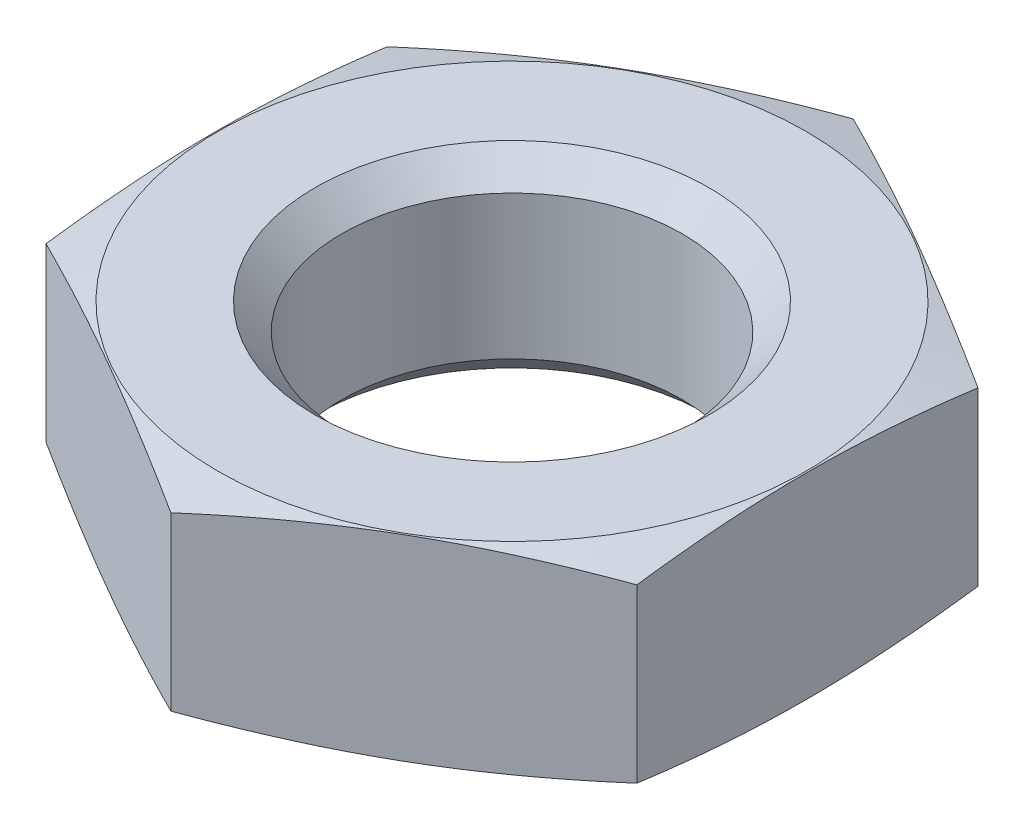
ISO-10303-21;
HEADER;
FILE_DESCRIPTION(('STEP AP214'),'2;1');
FILE_NAME('part.step','',(''),(''),'','','');
FILE_SCHEMA(('AUTOMOTIVE_DESIGN { 1 0 10303 214 1 1 1 1 }'));
ENDSEC;
DATA;
#1=APPLICATION_CONTEXT('core data for automotive mechanical design processes');
#2=APPLICATION_PROTOCOL_DEFINITION('international standard','automotive_design',2000,#1);
#3=PRODUCT_CONTEXT('',#1,'mechanical');
#4=PRODUCT('Part','Part','',(#3));
#5=PRODUCT_RELATED_PRODUCT_CATEGORY('part','',(#4));
#6=PRODUCT_DEFINITION_FORMATION('','',#4);
#7=PRODUCT_DEFINITION_CONTEXT('part definition',#1,'design');
#8=PRODUCT_DEFINITION('design','',#6,#7);
#9=PRODUCT_DEFINITION_SHAPE('','',#8);
#10=(LENGTH_UNIT() NAMED_UNIT(*) SI_UNIT(.MILLI.,.METRE.));
#11=(NAMED_UNIT(*) PLANE_ANGLE_UNIT() SI_UNIT($,.RADIAN.));
#12=(NAMED_UNIT(*) SI_UNIT($,.STERADIAN.) SOLID_ANGLE_UNIT());
#13=UNCERTAINTY_MEASURE_WITH_UNIT(LENGTH_MEASURE(1.E-05),#10,'distance_accuracy_value','');
#14=(GEOMETRIC_REPRESENTATION_CONTEXT(3) GLOBAL_UNCERTAINTY_ASSIGNED_CONTEXT((#13)) GLOBAL_UNIT_ASSIGNED_CONTEXT((#10,
#11,#12)) REPRESENTATION_CONTEXT('',''));
#15=CARTESIAN_POINT('',(0.,0.,0.));
#16=DIRECTION('',(0.,0.,1.));
#17=DIRECTION('',(1.,0.,0.));
#18=AXIS2_PLACEMENT_3D('',#15,#16,#17);
#19=CARTESIAN_POINT('',(0.,0.,0.));
#20=DIRECTION('',(0.,1.,0.));
#21=DIRECTION('',(0.,0.,1.));
#22=AXIS2_PLACEMENT_3D('',#19,#20,#21);
#23=PLANE('',#22);
#24=CARTESIAN_POINT('',(0.,0.,0.));
#25=DIRECTION('',(0.,1.,0.));
#26=DIRECTION('',(0.,0.,1.));
#27=AXIS2_PLACEMENT_3D('',#24,#25,#26);
#28=CIRCLE('',#27,8.);
#29=CARTESIAN_POINT('',(0.,0.,8.));
#30=VERTEX_POINT('',#29);
#31=EDGE_CURVE('E104',#30,#30,#28,.T.);
#32=ORIENTED_EDGE('',*,*,#31,.F.);
#33=EDGE_LOOP('',(#32));
#34=FACE_BOUND('',#33,.T.);
#35=CARTESIAN_POINT('',(0.,0.,0.));
#36=DIRECTION('',(0.,-1.,0.));
#37=DIRECTION('',(0.,0.,-1.));
#38=AXIS2_PLACEMENT_3D('',#35,#36,#37);
#39=CIRCLE('',#38,11.95);
#40=CARTESIAN_POINT('',(0.,0.,-11.95));
#41=VERTEX_POINT('',#40);
#42=EDGE_CURVE('E95',#41,#41,#39,.T.);
#43=ORIENTED_EDGE('',*,*,#42,.F.);
#44=EDGE_LOOP('',(#43));
#45=FACE_BOUND('',#44,.T.);
#46=ADVANCED_FACE('F35',(#34,#45),#23,.T.);
#47=CARTESIAN_POINT('',(0.,-4.,0.));
#48=DIRECTION('',(0.,-1.,0.));
#49=DIRECTION('',(0.,0.,-1.));
#50=AXIS2_PLACEMENT_3D('',#47,#48,#49);
#51=CONICAL_SURFACE('',#50,26.8782032302755,1.30899693899575);
#52=CARTESIAN_POINT('',(-12.,-3.3605663244196,21.3506083321315));
#53=CARTESIAN_POINT('',(-12.,-3.24051451811075,20.8365812914772));
#54=CARTESIAN_POINT('',(-12.,-3.1214194018048,20.3223286266765));
#55=CARTESIAN_POINT('',(-12.,-2.88557859713224,19.2932767815622));
#56=CARTESIAN_POINT('',(-12.,-2.76883294530673,18.7784775928795));
#57=CARTESIAN_POINT('',(-12.,-2.53811042323625,17.7481620695001));
#58=CARTESIAN_POINT('',(-12.,-2.42413404759575,17.2326456238308));
#59=CARTESIAN_POINT('',(-12.,-2.19954624033842,16.2008806093647));
#60=CARTESIAN_POINT('',(-12.,-2.08893479821236,15.6846320428598));
#61=CARTESIAN_POINT('',(-12.,-1.87072138984037,14.6462053578301));
#62=CARTESIAN_POINT('',(-12.,-1.76315961515309,14.1240187714419));
#63=CARTESIAN_POINT('',(-12.,-1.55311159371791,13.0786266604018));
#64=CARTESIAN_POINT('',(-12.,-1.45062530688961,12.5554211438303));
#65=CARTESIAN_POINT('',(-12.,-1.25186521080106,11.5077617597154));
#66=CARTESIAN_POINT('',(-12.,-1.15559214280881,10.9833077509315));
#67=CARTESIAN_POINT('',(-12.,-0.97069659006501,9.93304500621994));
#68=CARTESIAN_POINT('',(-12.,-0.882074102787994,9.40723627073948));
#69=CARTESIAN_POINT('',(-12.,-0.716524703370042,8.36862372339542));
#70=CARTESIAN_POINT('',(-12.,-0.639342791423745,7.85586083654386));
#71=CARTESIAN_POINT('',(-12.,-0.495715419215215,6.8288195099112));
#72=CARTESIAN_POINT('',(-12.,-0.429269962176992,6.31454106967504));
#73=CARTESIAN_POINT('',(-12.,-0.30918827133272,5.28461398767119));
#74=CARTESIAN_POINT('',(-12.,-0.255548593842444,4.76896575206389));
#75=CARTESIAN_POINT('',(-12.,-0.16312784144552,3.73632746896994));
#76=CARTESIAN_POINT('',(-12.,-0.124346566108353,3.21933743967795));
#77=CARTESIAN_POINT('',(-12.,-0.0635745863559813,2.18672472771525));
#78=CARTESIAN_POINT('',(-12.,-0.0415080133402603,1.67110658245426));
#79=CARTESIAN_POINT('',(-12.,-0.0150191406884103,0.639412565677404));
#80=CARTESIAN_POINT('',(-12.,-0.0105967330142481,0.123336696983613));
#81=CARTESIAN_POINT('',(-12.,-0.0196402957090047,-0.908689577838161));
#82=CARTESIAN_POINT('',(-12.,-0.0331074075558612,-1.42463997385904));
#83=CARTESIAN_POINT('',(-12.,-0.0772016182749232,-2.45578917745793));
#84=CARTESIAN_POINT('',(-12.,-0.107828705681445,-2.97098798553789));
#85=CARTESIAN_POINT('',(-12.,-0.202070733213038,-4.23182366614674));
#86=CARTESIAN_POINT('',(-12.,-0.274328574402961,-4.97681473997024));
#87=CARTESIAN_POINT('',(-12.,-0.445722221312974,-6.46358391972533));
#88=CARTESIAN_POINT('',(-12.,-0.54485744386696,-7.20536209501334));
#89=CARTESIAN_POINT('',(-12.,-0.764226777045544,-8.68831520023888));
#90=CARTESIAN_POINT('',(-12.,-0.884531311431521,-9.4294795501593));
#91=CARTESIAN_POINT('',(-12.,-1.14084078094572,-10.9090446336355));
#92=CARTESIAN_POINT('',(-12.,-1.27684552046276,-11.6474454015049));
#93=CARTESIAN_POINT('',(-12.,-1.56361321801144,-13.1376493344125));
#94=CARTESIAN_POINT('',(-12.,-1.71462852657603,-13.8894035595383));
#95=CARTESIAN_POINT('',(-12.,-2.02581207235839,-15.3910135724136));
#96=CARTESIAN_POINT('',(-12.,-2.18598042461436,-16.140869336179));
#97=CARTESIAN_POINT('',(-12.,-2.5122898452438,-17.6347366240789));
#98=CARTESIAN_POINT('',(-12.,-2.67839106115745,-18.3787568839426));
#99=CARTESIAN_POINT('',(-12.,-2.93147981116427,-19.4938627649605));
#100=CARTESIAN_POINT('',(-12.,-3.01649589183317,-19.8653978837125));
#101=CARTESIAN_POINT('',(-12.,-3.18769374338681,-20.608197734146));
#102=CARTESIAN_POINT('',(-12.,-3.27387550889288,-20.9794624670668));
#103=CARTESIAN_POINT('',(-12.,-3.3605663244196,-21.3506083321315));
#104=B_SPLINE_CURVE_WITH_KNOTS('',3,(#52,#53,#54,#55,#56,#57,#58,#59,#60,#61,#62,#63,#64,#65,
#66,#67,#68,#69,#70,#71,#72,#73,#74,#75,#76,#77,#78,#79,#80,#81,#82,#83,#84,#85,#86,#87,#88,#89,
#90,#91,#92,#93,#94,#95,#96,#97,#98,#99,#100,#101,#102,#103),.UNSPECIFIED.,.F.,.F.,(4,2,2,2,2,2,
2,2,2,2,2,2,2,2,2,2,2,2,2,2,2,2,2,2,2,4),(0.,1.5835824227092,3.16718945579779,4.75107727907931,
6.33496015511195,7.93438819506026,9.53380360254453,11.1334094768564,12.7330148231328,
14.2885389719994,15.844063587968,17.3991694254687,18.9542542848291,20.5022375500791,
22.0502113367666,23.5982838998801,25.146355428628,27.3911598113555,29.6359154918284,
31.8882850483462,34.1406265452858,36.4408686999616,38.7411397711321,41.0281213931497,
42.1715335901288,43.3149405130049),.UNSPECIFIED.);
#105=CARTESIAN_POINT('',(-12.,-0.510820071550119,6.92820323027551));
#106=VERTEX_POINT('',#105);
#107=CARTESIAN_POINT('',(-12.,-0.51082007155012,-6.92820323027551));
#108=VERTEX_POINT('',#107);
#109=EDGE_CURVE('E102',#106,#108,#104,.T.);
#110=ORIENTED_EDGE('',*,*,#109,.F.);
#111=CARTESIAN_POINT('',(0.000200000000000405,-0.510851012044539,13.8565219306048));
#112=CARTESIAN_POINT('',(-0.498146454182598,-0.433725446206089,13.5688014711328));
#113=CARTESIAN_POINT('',(-0.997396444623649,-0.363708257028759,13.2805593547588));
#114=CARTESIAN_POINT('',(-1.99765949891959,-0.240694738972755,12.7030572111006));
#115=CARTESIAN_POINT('',(-2.49867319556912,-0.187705323065104,12.4137968184723));
#116=CARTESIAN_POINT('',(-3.49942613336507,-0.101840731579636,11.8360118404435));
#117=CARTESIAN_POINT('',(-3.99915860797725,-0.0688631626605948,11.5474911617033));
#118=CARTESIAN_POINT('',(-4.99926081641629,-0.0246436291699185,10.9700818824439));
#119=CARTESIAN_POINT('',(-5.49963040820814,-0.0133974596215533,10.6811933639286));
#120=CARTESIAN_POINT('',(-6.50036959179186,-0.0133974596215536,10.1034163268979));
#121=CARTESIAN_POINT('',(-7.00073918358372,-0.024643629169919,9.81452780838259));
#122=CARTESIAN_POINT('',(-8.00084139202275,-0.0688631626605965,9.23711852912318));
#123=CARTESIAN_POINT('',(-8.50057386663493,-0.101840731579638,8.94859785038304));
#124=CARTESIAN_POINT('',(-9.50132680443088,-0.187705323065108,8.37081287235424));
#125=CARTESIAN_POINT('',(-10.0023405010804,-0.240694738972759,8.08155247972594));
#126=CARTESIAN_POINT('',(-11.0026035553764,-0.363708257028763,7.50405033606775));
#127=CARTESIAN_POINT('',(-11.5018535458174,-0.433725446206094,7.21580821969369));
#128=CARTESIAN_POINT('',(-12.0002,-0.510851012044544,6.92808776022167));
#129=B_SPLINE_CURVE_WITH_KNOTS('',3,(#111,#112,#113,#114,#115,#116,#117,#118,#119,#120,#121,
#122,#123,#124,#125,#126,#127,#128),.UNSPECIFIED.,.F.,.F.,(4,2,2,2,2,2,2,2,4),(0.,
1.74185054469228,3.48440735870376,5.21797126724054,6.95119970147062,8.68442813570069,
10.4179920442375,12.160548858249,13.9023994029412),.UNSPECIFIED.);
#130=CARTESIAN_POINT('',(0.,-0.510820071550114,13.856406460551));
#131=VERTEX_POINT('',#130);
#132=EDGE_CURVE('E139',#131,#106,#129,.T.);
#133=ORIENTED_EDGE('',*,*,#132,.F.);
#134=CARTESIAN_POINT('',(12.0002,-0.510851012044545,6.92808776022167));
#135=CARTESIAN_POINT('',(11.5018535458174,-0.433725446206094,7.21580821969369));
#136=CARTESIAN_POINT('',(11.0026035553764,-0.363708257028763,7.50405033606775));
#137=CARTESIAN_POINT('',(10.0023405010804,-0.240694738972758,8.08155247972594));
#138=CARTESIAN_POINT('',(9.50132680443088,-0.187705323065107,8.37081287235424));
#139=CARTESIAN_POINT('',(8.50057386663493,-0.101840731579638,8.94859785038304));
#140=CARTESIAN_POINT('',(8.00084139202275,-0.0688631626605974,9.23711852912318));
#141=CARTESIAN_POINT('',(7.00073918358372,-0.0246436291699195,9.81452780838259));
#142=CARTESIAN_POINT('',(6.50036959179186,-0.0133974596215529,10.1034163268979));
#143=CARTESIAN_POINT('',(5.49963040820814,-0.0133974596215527,10.6811933639286));
#144=CARTESIAN_POINT('',(4.99926081641628,-0.024643629169919,10.9700818824439));
#145=CARTESIAN_POINT('',(3.99915860797725,-0.0688631626605958,11.5474911617033));
#146=CARTESIAN_POINT('',(3.49942613336507,-0.101840731579636,11.8360118404435));
#147=CARTESIAN_POINT('',(2.49867319556912,-0.187705323065104,12.4137968184723));
#148=CARTESIAN_POINT('',(1.99765949891959,-0.240694738972754,12.7030572111006));
#149=CARTESIAN_POINT('',(0.997396444623648,-0.363708257028758,13.2805593547588));
#150=CARTESIAN_POINT('',(0.498146454182598,-0.433725446206088,13.5688014711328));
#151=CARTESIAN_POINT('',(-0.000200000000000334,-0.510851012044539,13.8565219306048));
#152=B_SPLINE_CURVE_WITH_KNOTS('',3,(#134,#135,#136,#137,#138,#139,#140,#141,#142,#143,#144,
#145,#146,#147,#148,#149,#150,#151),.UNSPECIFIED.,.F.,.F.,(4,2,2,2,2,2,2,2,4),(0.,
1.74185054469228,3.48440735870376,5.21797126724054,6.95119970147062,8.68442813570069,
10.4179920442375,12.160548858249,13.9023994029412),.UNSPECIFIED.);
#153=CARTESIAN_POINT('',(12.,-0.510820071550119,6.92820323027551));
#154=VERTEX_POINT('',#153);
#155=EDGE_CURVE('E146',#154,#131,#152,.T.);
#156=ORIENTED_EDGE('',*,*,#155,.F.);
#157=CARTESIAN_POINT('',(12.,-3.3605663244196,-21.3506083321315));
#158=CARTESIAN_POINT('',(12.,-3.24051451811075,-20.8365812914772));
#159=CARTESIAN_POINT('',(12.,-3.1214194018048,-20.3223286266765));
#160=CARTESIAN_POINT('',(12.,-2.88557859713224,-19.2932767815622));
#161=CARTESIAN_POINT('',(12.,-2.76883294530673,-18.7784775928795));
#162=CARTESIAN_POINT('',(12.,-2.53811042323625,-17.7481620695001));
#163=CARTESIAN_POINT('',(12.,-2.42413404759575,-17.2326456238308));
#164=CARTESIAN_POINT('',(12.,-2.19954624033842,-16.2008806093647));
#165=CARTESIAN_POINT('',(12.,-2.08893479821236,-15.6846320428598));
#166=CARTESIAN_POINT('',(12.,-1.87072138984037,-14.6462053578301));
#167=CARTESIAN_POINT('',(12.,-1.76315961515309,-14.1240187714419));
#168=CARTESIAN_POINT('',(12.,-1.55311159371791,-13.0786266604018));
#169=CARTESIAN_POINT('',(12.,-1.45062530688961,-12.5554211438303));
#170=CARTESIAN_POINT('',(12.,-1.25186521080106,-11.5077617597154));
#171=CARTESIAN_POINT('',(12.,-1.15559214280881,-10.9833077509315));
#172=CARTESIAN_POINT('',(12.,-0.97069659006501,-9.93304500621994));
#173=CARTESIAN_POINT('',(12.,-0.882074102787994,-9.40723627073948));
#174=CARTESIAN_POINT('',(12.,-0.716524703370042,-8.36862372339542));
#175=CARTESIAN_POINT('',(12.,-0.639342791423745,-7.85586083654386));
#176=CARTESIAN_POINT('',(12.,-0.495715419215215,-6.8288195099112));
#177=CARTESIAN_POINT('',(12.,-0.429269962176992,-6.31454106967504));
#178=CARTESIAN_POINT('',(12.,-0.30918827133272,-5.28461398767119));
#179=CARTESIAN_POINT('',(12.,-0.255548593842444,-4.76896575206389));
#180=CARTESIAN_POINT('',(12.,-0.16312784144552,-3.73632746896994));
#181=CARTESIAN_POINT('',(12.,-0.124346566108353,-3.21933743967795));
#182=CARTESIAN_POINT('',(12.,-0.0635745863559813,-2.18672472771525));
#183=CARTESIAN_POINT('',(12.,-0.0415080133402603,-1.67110658245426));
#184=CARTESIAN_POINT('',(12.,-0.0150191406884103,-0.639412565677404));
#185=CARTESIAN_POINT('',(12.,-0.0105967330142481,-0.123336696983613));
#186=CARTESIAN_POINT('',(12.,-0.0196402957090047,0.908689577838161));
#187=CARTESIAN_POINT('',(12.,-0.0331074075558612,1.42463997385904));
#188=CARTESIAN_POINT('',(12.,-0.0772016182749232,2.45578917745793));
#189=CARTESIAN_POINT('',(12.,-0.107828705681445,2.97098798553789));
#190=CARTESIAN_POINT('',(12.,-0.202070733213038,4.23182366614674));
#191=CARTESIAN_POINT('',(12.,-0.274328574402961,4.97681473997024));
#192=CARTESIAN_POINT('',(12.,-0.445722221312974,6.46358391972533));
#193=CARTESIAN_POINT('',(12.,-0.54485744386696,7.20536209501334));
#194=CARTESIAN_POINT('',(12.,-0.764226777045544,8.68831520023888));
#195=CARTESIAN_POINT('',(12.,-0.884531311431521,9.4294795501593));
#196=CARTESIAN_POINT('',(12.,-1.14084078094572,10.9090446336355));
#197=CARTESIAN_POINT('',(12.,-1.27684552046276,11.6474454015049));
#198=CARTESIAN_POINT('',(12.,-1.56361321801144,13.1376493344125));
#199=CARTESIAN_POINT('',(12.,-1.71462852657603,13.8894035595383));
#200=CARTESIAN_POINT('',(12.,-2.02581207235839,15.3910135724136));
#201=CARTESIAN_POINT('',(12.,-2.18598042461436,16.140869336179));
#202=CARTESIAN_POINT('',(12.,-2.5122898452438,17.6347366240789));
#203=CARTESIAN_POINT('',(12.,-2.67839106115745,18.3787568839426));
#204=CARTESIAN_POINT('',(12.,-2.93147981116427,19.4938627649605));
#205=CARTESIAN_POINT('',(12.,-3.01649589183317,19.8653978837125));
#206=CARTESIAN_POINT('',(12.,-3.18769374338681,20.608197734146));
#207=CARTESIAN_POINT('',(12.,-3.27387550889288,20.9794624670668));
#208=CARTESIAN_POINT('',(12.,-3.3605663244196,21.3506083321315));
#209=B_SPLINE_CURVE_WITH_KNOTS('',3,(#157,#158,#159,#160,#161,#162,#163,#164,#165,#166,#167,
#168,#169,#170,#171,#172,#173,#174,#175,#176,#177,#178,#179,#180,#181,#182,#183,#184,#185,#186,
#187,#188,#189,#190,#191,#192,#193,#194,#195,#196,#197,#198,#199,#200,#201,#202,#203,#204,#205,
#206,#207,#208),.UNSPECIFIED.,.F.,.F.,(4,2,2,2,2,2,2,2,2,2,2,2,2,2,2,2,2,2,2,2,2,2,2,2,2,4),(0.,
1.5835824227092,3.16718945579779,4.75107727907931,6.33496015511195,7.93438819506026,
9.53380360254453,11.1334094768564,12.7330148231328,14.2885389719994,15.844063587968,
17.3991694254687,18.9542542848291,20.5022375500791,22.0502113367666,23.5982838998801,
25.146355428628,27.3911598113555,29.6359154918284,31.8882850483462,34.1406265452858,
36.4408686999616,38.7411397711321,41.0281213931497,42.1715335901288,43.3149405130049),.UNSPECIFIED.);
#210=CARTESIAN_POINT('',(12.,-0.510820071550119,-6.92820323027551));
#211=VERTEX_POINT('',#210);
#212=EDGE_CURVE('E181',#211,#154,#209,.T.);
#213=ORIENTED_EDGE('',*,*,#212,.F.);
#214=CARTESIAN_POINT('',(-0.000200000000000405,-0.510851012044539,-13.8565219306048));
#215=CARTESIAN_POINT('',(0.498146454182598,-0.433725446206089,-13.5688014711328));
#216=CARTESIAN_POINT('',(0.997396444623649,-0.363708257028759,-13.2805593547588));
#217=CARTESIAN_POINT('',(1.99765949891959,-0.240694738972755,-12.7030572111006));
#218=CARTESIAN_POINT('',(2.49867319556912,-0.187705323065104,-12.4137968184723));
#219=CARTESIAN_POINT('',(3.49942613336507,-0.101840731579636,-11.8360118404435));
#220=CARTESIAN_POINT('',(3.99915860797725,-0.0688631626605948,-11.5474911617033));
#221=CARTESIAN_POINT('',(4.99926081641629,-0.0246436291699185,-10.9700818824439));
#222=CARTESIAN_POINT('',(5.49963040820814,-0.0133974596215533,-10.6811933639286));
#223=CARTESIAN_POINT('',(6.50036959179186,-0.0133974596215536,-10.1034163268979));
#224=CARTESIAN_POINT('',(7.00073918358372,-0.024643629169919,-9.81452780838259));
#225=CARTESIAN_POINT('',(8.00084139202275,-0.0688631626605965,-9.23711852912318));
#226=CARTESIAN_POINT('',(8.50057386663493,-0.101840731579638,-8.94859785038304));
#227=CARTESIAN_POINT('',(9.50132680443088,-0.187705323065108,-8.37081287235424));
#228=CARTESIAN_POINT('',(10.0023405010804,-0.240694738972759,-8.08155247972594));
#229=CARTESIAN_POINT('',(11.0026035553764,-0.363708257028763,-7.50405033606775));
#230=CARTESIAN_POINT('',(11.5018535458174,-0.433725446206094,-7.21580821969369));
#231=CARTESIAN_POINT('',(12.0002,-0.510851012044544,-6.92808776022167));
#232=B_SPLINE_CURVE_WITH_KNOTS('',3,(#214,#215,#216,#217,#218,#219,#220,#221,#222,#223,#224,
#225,#226,#227,#228,#229,#230,#231),.UNSPECIFIED.,.F.,.F.,(4,2,2,2,2,2,2,2,4),(0.,
1.74185054469228,3.48440735870376,5.21797126724054,6.95119970147062,8.68442813570069,
10.4179920442375,12.160548858249,13.9023994029412),.UNSPECIFIED.);
#233=CARTESIAN_POINT('',(0.,-0.510820071550114,-13.856406460551));
#234=VERTEX_POINT('',#233);
#235=EDGE_CURVE('E174',#234,#211,#232,.T.);
#236=ORIENTED_EDGE('',*,*,#235,.F.);
#237=CARTESIAN_POINT('',(-12.0002,-0.510851012044545,-6.92808776022167));
#238=CARTESIAN_POINT('',(-11.5018535458174,-0.433725446206094,-7.21580821969369));
#239=CARTESIAN_POINT('',(-11.0026035553764,-0.363708257028763,-7.50405033606775));
#240=CARTESIAN_POINT('',(-10.0023405010804,-0.240694738972758,-8.08155247972594));
#241=CARTESIAN_POINT('',(-9.50132680443088,-0.187705323065107,-8.37081287235424));
#242=CARTESIAN_POINT('',(-8.50057386663493,-0.101840731579638,-8.94859785038304));
#243=CARTESIAN_POINT('',(-8.00084139202275,-0.0688631626605974,-9.23711852912318));
#244=CARTESIAN_POINT('',(-7.00073918358372,-0.0246436291699195,-9.81452780838259));
#245=CARTESIAN_POINT('',(-6.50036959179186,-0.0133974596215529,-10.1034163268979));
#246=CARTESIAN_POINT('',(-5.49963040820814,-0.0133974596215527,-10.6811933639286));
#247=CARTESIAN_POINT('',(-4.99926081641628,-0.024643629169919,-10.9700818824439));
#248=CARTESIAN_POINT('',(-3.99915860797725,-0.0688631626605958,-11.5474911617033));
#249=CARTESIAN_POINT('',(-3.49942613336507,-0.101840731579636,-11.8360118404435));
#250=CARTESIAN_POINT('',(-2.49867319556912,-0.187705323065104,-12.4137968184723));
#251=CARTESIAN_POINT('',(-1.99765949891959,-0.240694738972754,-12.7030572111006));
#252=CARTESIAN_POINT('',(-0.997396444623648,-0.363708257028758,-13.2805593547588));
#253=CARTESIAN_POINT('',(-0.498146454182598,-0.433725446206088,-13.5688014711328));
#254=CARTESIAN_POINT('',(0.000200000000000334,-0.510851012044539,-13.8565219306048));
#255=B_SPLINE_CURVE_WITH_KNOTS('',3,(#237,#238,#239,#240,#241,#242,#243,#244,#245,#246,#247,
#248,#249,#250,#251,#252,#253,#254),.UNSPECIFIED.,.F.,.F.,(4,2,2,2,2,2,2,2,4),(0.,
1.74185054469228,3.48440735870376,5.21797126724054,6.95119970147062,8.68442813570069,
10.4179920442375,12.160548858249,13.9023994029412),.UNSPECIFIED.);
#256=EDGE_CURVE('E164',#108,#234,#255,.T.);
#257=ORIENTED_EDGE('',*,*,#256,.F.);
#258=EDGE_LOOP('',(#110,#133,#156,#213,#236,#257));
#259=FACE_BOUND('',#258,.T.);
#260=ORIENTED_EDGE('',*,*,#42,.T.);
#261=EDGE_LOOP('',(#260));
#262=FACE_BOUND('',#261,.T.);
#263=ADVANCED_FACE('F157',(#259,#262),#51,.T.);
#264=CARTESIAN_POINT('',(-12.,9.,-6.92820323027551));
#265=DIRECTION('',(1.,0.,0.));
#266=DIRECTION('',(0.,0.,-1.));
#267=AXIS2_PLACEMENT_3D('',#264,#265,#266);
#268=PLANE('',#267);
#269=ORIENTED_EDGE('',*,*,#109,.T.);
#270=DIRECTION('',(0.,-1.,0.));
#271=VECTOR('',#270,1.);
#272=CARTESIAN_POINT('',(-12.,9.,-6.92820323027551));
#273=LINE('',#272,#271);
#274=CARTESIAN_POINT('',(-12.,-7.48917992844988,-6.92820323027551));
#275=VERTEX_POINT('',#274);
#276=EDGE_CURVE('E55',#108,#275,#273,.T.);
#277=ORIENTED_EDGE('',*,*,#276,.T.);
#278=CARTESIAN_POINT('',(-12.,-4.6394336755804,-21.3506083321315));
#279=CARTESIAN_POINT('',(-12.,-4.75948548188925,-20.8365812914772));
#280=CARTESIAN_POINT('',(-12.,-4.87858059819519,-20.3223286266765));
#281=CARTESIAN_POINT('',(-12.,-5.11442140286776,-19.2932767815622));
#282=CARTESIAN_POINT('',(-12.,-5.23116705469327,-18.7784775928795));
#283=CARTESIAN_POINT('',(-12.,-5.46188957676375,-17.7481620695001));
#284=CARTESIAN_POINT('',(-12.,-5.57586595240425,-17.2326456238308));
#285=CARTESIAN_POINT('',(-12.,-5.80045375966158,-16.2008806093647));
#286=CARTESIAN_POINT('',(-12.,-5.91106520178764,-15.6846320428598));
#287=CARTESIAN_POINT('',(-12.,-6.12927861015963,-14.6462053578301));
#288=CARTESIAN_POINT('',(-12.,-6.23684038484691,-14.1240187714419));
#289=CARTESIAN_POINT('',(-12.,-6.44688840628209,-13.0786266604018));
#290=CARTESIAN_POINT('',(-12.,-6.54937469311039,-12.5554211438303));
#291=CARTESIAN_POINT('',(-12.,-6.74813478919894,-11.5077617597154));
#292=CARTESIAN_POINT('',(-12.,-6.84440785719119,-10.9833077509315));
#293=CARTESIAN_POINT('',(-12.,-7.02930340993499,-9.93304500621995));
#294=CARTESIAN_POINT('',(-12.,-7.117925897212,-9.40723627073949));
#295=CARTESIAN_POINT('',(-12.,-7.28347529662996,-8.36862372339542));
#296=CARTESIAN_POINT('',(-12.,-7.36065720857625,-7.85586083654386));
#297=CARTESIAN_POINT('',(-12.,-7.50428458078478,-6.8288195099112));
#298=CARTESIAN_POINT('',(-12.,-7.57073003782301,-6.31454106967504));
#299=CARTESIAN_POINT('',(-12.,-7.69081172866728,-5.28461398767119));
#300=CARTESIAN_POINT('',(-12.,-7.74445140615756,-4.76896575206389));
#301=CARTESIAN_POINT('',(-12.,-7.83687215855448,-3.73632746896994));
#302=CARTESIAN_POINT('',(-12.,-7.87565343389165,-3.21933743967795));
#303=CARTESIAN_POINT('',(-12.,-7.93642541364402,-2.18672472771525));
#304=CARTESIAN_POINT('',(-12.,-7.95849198665974,-1.67110658245426));
#305=CARTESIAN_POINT('',(-12.,-7.98498085931159,-0.639412565677404));
#306=CARTESIAN_POINT('',(-12.,-7.98940326698575,-0.123336696983613));
#307=CARTESIAN_POINT('',(-12.,-7.98035970429099,0.908689577838162));
#308=CARTESIAN_POINT('',(-12.,-7.96689259244414,1.42463997385904));
#309=CARTESIAN_POINT('',(-12.,-7.92279838172508,2.45578917745793));
#310=CARTESIAN_POINT('',(-12.,-7.89217129431855,2.97098798553789));
#311=CARTESIAN_POINT('',(-12.,-7.79792926678696,4.23182366614674));
#312=CARTESIAN_POINT('',(-12.,-7.72567142559704,4.97681473997024));
#313=CARTESIAN_POINT('',(-12.,-7.55427777868703,6.46358391972533));
#314=CARTESIAN_POINT('',(-12.,-7.45514255613304,7.20536209501334));
#315=CARTESIAN_POINT('',(-12.,-7.23577322295445,8.68831520023888));
#316=CARTESIAN_POINT('',(-12.,-7.11546868856848,9.4294795501593));
#317=CARTESIAN_POINT('',(-12.,-6.85915921905428,10.9090446336355));
#318=CARTESIAN_POINT('',(-12.,-6.72315447953724,11.6474454015049));
#319=CARTESIAN_POINT('',(-12.,-6.43638678198856,13.1376493344125));
#320=CARTESIAN_POINT('',(-12.,-6.28537147342397,13.8894035595383));
#321=CARTESIAN_POINT('',(-12.,-5.97418792764161,15.3910135724136));
#322=CARTESIAN_POINT('',(-12.,-5.81401957538564,16.140869336179));
#323=CARTESIAN_POINT('',(-12.,-5.4877101547562,17.6347366240789));
#324=CARTESIAN_POINT('',(-12.,-5.32160893884255,18.3787568839426));
#325=CARTESIAN_POINT('',(-12.,-5.06852018883573,19.4938627649605));
#326=CARTESIAN_POINT('',(-12.,-4.98350410816683,19.8653978837125));
#327=CARTESIAN_POINT('',(-12.,-4.81230625661319,20.608197734146));
#328=CARTESIAN_POINT('',(-12.,-4.72612449110712,20.9794624670668));
#329=CARTESIAN_POINT('',(-12.,-4.6394336755804,21.3506083321315));
#330=B_SPLINE_CURVE_WITH_KNOTS('',3,(#278,#279,#280,#281,#282,#283,#284,#285,#286,#287,#288,
#289,#290,#291,#292,#293,#294,#295,#296,#297,#298,#299,#300,#301,#302,#303,#304,#305,#306,#307,
#308,#309,#310,#311,#312,#313,#314,#315,#316,#317,#318,#319,#320,#321,#322,#323,#324,#325,#326,
#327,#328,#329),.UNSPECIFIED.,.F.,.F.,(4,2,2,2,2,2,2,2,2,2,2,2,2,2,2,2,2,2,2,2,2,2,2,2,2,4),(0.,
1.5835824227092,3.16718945579779,4.75107727907931,6.33496015511195,7.93438819506026,
9.53380360254453,11.1334094768564,12.7330148231328,14.2885389719994,15.844063587968,
17.3991694254686,18.9542542848291,20.5022375500791,22.0502113367666,23.5982838998801,
25.146355428628,27.3911598113555,29.6359154918284,31.8882850483462,34.1406265452858,
36.4408686999616,38.7411397711321,41.0281213931497,42.1715335901288,43.3149405130049),.UNSPECIFIED.);
#331=CARTESIAN_POINT('',(-12.,-7.48917992844988,6.92820323027551));
#332=VERTEX_POINT('',#331);
#333=EDGE_CURVE('E11',#275,#332,#330,.T.);
#334=ORIENTED_EDGE('',*,*,#333,.T.);
#335=DIRECTION('',(0.,-1.,0.));
#336=VECTOR('',#335,1.);
#337=CARTESIAN_POINT('',(-12.,9.,6.92820323027551));
#338=LINE('',#337,#336);
#339=EDGE_CURVE('E267',#106,#332,#338,.T.);
#340=ORIENTED_EDGE('',*,*,#339,.F.);
#341=EDGE_LOOP('',(#269,#277,#334,#340));
#342=FACE_BOUND('',#341,.T.);
#343=ADVANCED_FACE('F98',(#342),#268,.F.);
#344=CARTESIAN_POINT('',(-12.,9.,6.92820323027551));
#345=DIRECTION('',(0.499999999999999,0.,-0.866025403784439));
#346=DIRECTION('',(-0.866025403784439,0.,-0.499999999999999));
#347=AXIS2_PLACEMENT_3D('',#344,#345,#346);
#348=PLANE('',#347);
#349=ORIENTED_EDGE('',*,*,#132,.T.);
#350=ORIENTED_EDGE('',*,*,#339,.T.);
#351=CARTESIAN_POINT('',(-12.0002,-7.48914898795546,6.92808776022167));
#352=CARTESIAN_POINT('',(-11.5018535458174,-7.56627455379391,7.21580821969369));
#353=CARTESIAN_POINT('',(-11.0026035553764,-7.63629174297124,7.50405033606775));
#354=CARTESIAN_POINT('',(-10.0023405010804,-7.75930526102724,8.08155247972594));
#355=CARTESIAN_POINT('',(-9.50132680443088,-7.81229467693489,8.37081287235424));
#356=CARTESIAN_POINT('',(-8.50057386663493,-7.89815926842036,8.94859785038304));
#357=CARTESIAN_POINT('',(-8.00084139202275,-7.9311368373394,9.23711852912318));
#358=CARTESIAN_POINT('',(-7.00073918358372,-7.97535637083008,9.81452780838259));
#359=CARTESIAN_POINT('',(-6.50036959179186,-7.98660254037845,10.1034163268979));
#360=CARTESIAN_POINT('',(-5.49963040820814,-7.98660254037845,10.6811933639286));
#361=CARTESIAN_POINT('',(-4.99926081641628,-7.97535637083008,10.9700818824439));
#362=CARTESIAN_POINT('',(-3.99915860797725,-7.9311368373394,11.5474911617033));
#363=CARTESIAN_POINT('',(-3.49942613336507,-7.89815926842036,11.8360118404435));
#364=CARTESIAN_POINT('',(-2.49867319556912,-7.8122946769349,12.4137968184723));
#365=CARTESIAN_POINT('',(-1.99765949891959,-7.75930526102725,12.7030572111006));
#366=CARTESIAN_POINT('',(-0.997396444623649,-7.63629174297124,13.2805593547588));
#367=CARTESIAN_POINT('',(-0.498146454182599,-7.56627455379391,13.5688014711328));
#368=CARTESIAN_POINT('',(0.000200000000000205,-7.48914898795546,13.8565219306048));
#369=B_SPLINE_CURVE_WITH_KNOTS('',3,(#351,#352,#353,#354,#355,#356,#357,#358,#359,#360,#361,
#362,#363,#364,#365,#366,#367,#368),.UNSPECIFIED.,.F.,.F.,(4,2,2,2,2,2,2,2,4),(0.,
1.74185054469228,3.48440735870376,5.21797126724054,6.95119970147061,8.68442813570069,
10.4179920442375,12.1605488582489,13.9023994029412),.UNSPECIFIED.);
#370=CARTESIAN_POINT('',(0.,-7.48917992844988,13.856406460551));
#371=VERTEX_POINT('',#370);
#372=EDGE_CURVE('E48',#332,#371,#369,.T.);
#373=ORIENTED_EDGE('',*,*,#372,.T.);
#374=DIRECTION('',(0.,-1.,0.));
#375=VECTOR('',#374,1.);
#376=CARTESIAN_POINT('',(0.,9.,13.856406460551));
#377=LINE('',#376,#375);
#378=EDGE_CURVE('E266',#131,#371,#377,.T.);
#379=ORIENTED_EDGE('',*,*,#378,.F.);
#380=EDGE_LOOP('',(#349,#350,#373,#379));
#381=FACE_BOUND('',#380,.T.);
#382=ADVANCED_FACE('F130',(#381),#348,.F.);
#383=CARTESIAN_POINT('',(0.,9.,13.856406460551));
#384=DIRECTION('',(-0.499999999999999,0.,-0.866025403784439));
#385=DIRECTION('',(-0.866025403784439,0.,0.499999999999999));
#386=AXIS2_PLACEMENT_3D('',#383,#384,#385);
#387=PLANE('',#386);
#388=ORIENTED_EDGE('',*,*,#155,.T.);
#389=ORIENTED_EDGE('',*,*,#378,.T.);
#390=CARTESIAN_POINT('',(-0.000200000000000096,-7.48914898795546,13.8565219306048));
#391=CARTESIAN_POINT('',(0.4981464541826,-7.56627455379391,13.5688014711328));
#392=CARTESIAN_POINT('',(0.997396444623649,-7.63629174297124,13.2805593547588));
#393=CARTESIAN_POINT('',(1.99765949891959,-7.75930526102725,12.7030572111006));
#394=CARTESIAN_POINT('',(2.49867319556912,-7.8122946769349,12.4137968184723));
#395=CARTESIAN_POINT('',(3.49942613336507,-7.89815926842036,11.8360118404435));
#396=CARTESIAN_POINT('',(3.99915860797726,-7.9311368373394,11.5474911617033));
#397=CARTESIAN_POINT('',(4.99926081641629,-7.97535637083008,10.9700818824439));
#398=CARTESIAN_POINT('',(5.49963040820814,-7.98660254037845,10.6811933639286));
#399=CARTESIAN_POINT('',(6.50036959179186,-7.98660254037845,10.1034163268979));
#400=CARTESIAN_POINT('',(7.00073918358372,-7.97535637083008,9.81452780838259));
#401=CARTESIAN_POINT('',(8.00084139202275,-7.9311368373394,9.23711852912318));
#402=CARTESIAN_POINT('',(8.50057386663493,-7.89815926842036,8.94859785038304));
#403=CARTESIAN_POINT('',(9.50132680443088,-7.81229467693489,8.37081287235424));
#404=CARTESIAN_POINT('',(10.0023405010804,-7.75930526102724,8.08155247972594));
#405=CARTESIAN_POINT('',(11.0026035553764,-7.63629174297123,7.50405033606775));
#406=CARTESIAN_POINT('',(11.5018535458174,-7.5662745537939,7.21580821969369));
#407=CARTESIAN_POINT('',(12.0002,-7.48914898795545,6.92808776022167));
#408=B_SPLINE_CURVE_WITH_KNOTS('',3,(#390,#391,#392,#393,#394,#395,#396,#397,#398,#399,#400,
#401,#402,#403,#404,#405,#406,#407),.UNSPECIFIED.,.F.,.F.,(4,2,2,2,2,2,2,2,4),(0.,
1.74185054469228,3.48440735870376,5.21797126724054,6.95119970147062,8.68442813570069,
10.4179920442375,12.160548858249,13.9023994029412),.UNSPECIFIED.);
#409=CARTESIAN_POINT('',(12.,-7.48917992844988,6.92820323027551));
#410=VERTEX_POINT('',#409);
#411=EDGE_CURVE('E111',#371,#410,#408,.T.);
#412=ORIENTED_EDGE('',*,*,#411,.T.);
#413=DIRECTION('',(0.,-1.,0.));
#414=VECTOR('',#413,1.);
#415=CARTESIAN_POINT('',(12.,9.,6.92820323027551));
#416=LINE('',#415,#414);
#417=EDGE_CURVE('E263',#154,#410,#416,.T.);
#418=ORIENTED_EDGE('',*,*,#417,.F.);
#419=EDGE_LOOP('',(#388,#389,#412,#418));
#420=FACE_BOUND('',#419,.T.);
#421=ADVANCED_FACE('F133',(#420),#387,.F.);
#422=CARTESIAN_POINT('',(12.,9.,6.92820323027551));
#423=DIRECTION('',(-1.,0.,0.));
#424=DIRECTION('',(0.,0.,1.));
#425=AXIS2_PLACEMENT_3D('',#422,#423,#424);
#426=PLANE('',#425);
#427=ORIENTED_EDGE('',*,*,#212,.T.);
#428=ORIENTED_EDGE('',*,*,#417,.T.);
#429=CARTESIAN_POINT('',(12.,-4.6394336755804,21.3506083321315));
#430=CARTESIAN_POINT('',(12.,-4.75948548188925,20.8365812914772));
#431=CARTESIAN_POINT('',(12.,-4.87858059819519,20.3223286266765));
#432=CARTESIAN_POINT('',(12.,-5.11442140286776,19.2932767815622));
#433=CARTESIAN_POINT('',(12.,-5.23116705469327,18.7784775928795));
#434=CARTESIAN_POINT('',(12.,-5.46188957676375,17.7481620695001));
#435=CARTESIAN_POINT('',(12.,-5.57586595240425,17.2326456238308));
#436=CARTESIAN_POINT('',(12.,-5.80045375966158,16.2008806093647));
#437=CARTESIAN_POINT('',(12.,-5.91106520178764,15.6846320428598));
#438=CARTESIAN_POINT('',(12.,-6.12927861015963,14.6462053578301));
#439=CARTESIAN_POINT('',(12.,-6.23684038484691,14.1240187714419));
#440=CARTESIAN_POINT('',(12.,-6.44688840628209,13.0786266604018));
#441=CARTESIAN_POINT('',(12.,-6.54937469311039,12.5554211438303));
#442=CARTESIAN_POINT('',(12.,-6.74813478919894,11.5077617597154));
#443=CARTESIAN_POINT('',(12.,-6.84440785719119,10.9833077509315));
#444=CARTESIAN_POINT('',(12.,-7.02930340993499,9.93304500621995));
#445=CARTESIAN_POINT('',(12.,-7.117925897212,9.40723627073949));
#446=CARTESIAN_POINT('',(12.,-7.28347529662996,8.36862372339542));
#447=CARTESIAN_POINT('',(12.,-7.36065720857625,7.85586083654386));
#448=CARTESIAN_POINT('',(12.,-7.50428458078478,6.8288195099112));
#449=CARTESIAN_POINT('',(12.,-7.57073003782301,6.31454106967504));
#450=CARTESIAN_POINT('',(12.,-7.69081172866728,5.28461398767119));
#451=CARTESIAN_POINT('',(12.,-7.74445140615756,4.76896575206389));
#452=CARTESIAN_POINT('',(12.,-7.83687215855448,3.73632746896994));
#453=CARTESIAN_POINT('',(12.,-7.87565343389165,3.21933743967795));
#454=CARTESIAN_POINT('',(12.,-7.93642541364402,2.18672472771525));
#455=CARTESIAN_POINT('',(12.,-7.95849198665974,1.67110658245426));
#456=CARTESIAN_POINT('',(12.,-7.98498085931159,0.639412565677404));
#457=CARTESIAN_POINT('',(12.,-7.98940326698575,0.123336696983613));
#458=CARTESIAN_POINT('',(12.,-7.98035970429099,-0.908689577838162));
#459=CARTESIAN_POINT('',(12.,-7.96689259244414,-1.42463997385904));
#460=CARTESIAN_POINT('',(12.,-7.92279838172508,-2.45578917745793));
#461=CARTESIAN_POINT('',(12.,-7.89217129431855,-2.97098798553789));
#462=CARTESIAN_POINT('',(12.,-7.79792926678696,-4.23182366614674));
#463=CARTESIAN_POINT('',(12.,-7.72567142559704,-4.97681473997024));
#464=CARTESIAN_POINT('',(12.,-7.55427777868703,-6.46358391972533));
#465=CARTESIAN_POINT('',(12.,-7.45514255613304,-7.20536209501334));
#466=CARTESIAN_POINT('',(12.,-7.23577322295445,-8.68831520023888));
#467=CARTESIAN_POINT('',(12.,-7.11546868856848,-9.4294795501593));
#468=CARTESIAN_POINT('',(12.,-6.85915921905428,-10.9090446336355));
#469=CARTESIAN_POINT('',(12.,-6.72315447953724,-11.6474454015049));
#470=CARTESIAN_POINT('',(12.,-6.43638678198856,-13.1376493344125));
#471=CARTESIAN_POINT('',(12.,-6.28537147342397,-13.8894035595383));
#472=CARTESIAN_POINT('',(12.,-5.97418792764161,-15.3910135724136));
#473=CARTESIAN_POINT('',(12.,-5.81401957538564,-16.140869336179));
#474=CARTESIAN_POINT('',(12.,-5.4877101547562,-17.6347366240789));
#475=CARTESIAN_POINT('',(12.,-5.32160893884255,-18.3787568839426));
#476=CARTESIAN_POINT('',(12.,-5.06852018883573,-19.4938627649605));
#477=CARTESIAN_POINT('',(12.,-4.98350410816683,-19.8653978837125));
#478=CARTESIAN_POINT('',(12.,-4.81230625661319,-20.608197734146));
#479=CARTESIAN_POINT('',(12.,-4.72612449110712,-20.9794624670668));
#480=CARTESIAN_POINT('',(12.,-4.6394336755804,-21.3506083321315));
#481=B_SPLINE_CURVE_WITH_KNOTS('',3,(#429,#430,#431,#432,#433,#434,#435,#436,#437,#438,#439,
#440,#441,#442,#443,#444,#445,#446,#447,#448,#449,#450,#451,#452,#453,#454,#455,#456,#457,#458,
#459,#460,#461,#462,#463,#464,#465,#466,#467,#468,#469,#470,#471,#472,#473,#474,#475,#476,#477,
#478,#479,#480),.UNSPECIFIED.,.F.,.F.,(4,2,2,2,2,2,2,2,2,2,2,2,2,2,2,2,2,2,2,2,2,2,2,2,2,4),(0.,
1.5835824227092,3.16718945579779,4.75107727907931,6.33496015511195,7.93438819506026,
9.53380360254453,11.1334094768564,12.7330148231328,14.2885389719994,15.844063587968,
17.3991694254686,18.9542542848291,20.5022375500791,22.0502113367666,23.5982838998801,
25.146355428628,27.3911598113555,29.6359154918284,31.8882850483462,34.1406265452858,
36.4408686999616,38.7411397711321,41.0281213931497,42.1715335901288,43.3149405130049),.UNSPECIFIED.);
#482=CARTESIAN_POINT('',(12.,-7.48917992844988,-6.92820323027551));
#483=VERTEX_POINT('',#482);
#484=EDGE_CURVE('E115',#410,#483,#481,.T.);
#485=ORIENTED_EDGE('',*,*,#484,.T.);
#486=DIRECTION('',(0.,-1.,0.));
#487=VECTOR('',#486,1.);
#488=CARTESIAN_POINT('',(12.,9.,-6.92820323027551));
#489=LINE('',#488,#487);
#490=EDGE_CURVE('E260',#211,#483,#489,.T.);
#491=ORIENTED_EDGE('',*,*,#490,.F.);
#492=EDGE_LOOP('',(#427,#428,#485,#491));
#493=FACE_BOUND('',#492,.T.);
#494=ADVANCED_FACE('F186',(#493),#426,.F.);
#495=CARTESIAN_POINT('',(12.,9.,-6.92820323027551));
#496=DIRECTION('',(-0.499999999999999,0.,0.866025403784439));
#497=DIRECTION('',(0.866025403784439,0.,0.499999999999999));
#498=AXIS2_PLACEMENT_3D('',#495,#496,#497);
#499=PLANE('',#498);
#500=ORIENTED_EDGE('',*,*,#235,.T.);
#501=ORIENTED_EDGE('',*,*,#490,.T.);
#502=CARTESIAN_POINT('',(12.0002,-7.48914898795546,-6.92808776022167));
#503=CARTESIAN_POINT('',(11.5018535458174,-7.56627455379391,-7.21580821969369));
#504=CARTESIAN_POINT('',(11.0026035553764,-7.63629174297124,-7.50405033606775));
#505=CARTESIAN_POINT('',(10.0023405010804,-7.75930526102724,-8.08155247972594));
#506=CARTESIAN_POINT('',(9.50132680443088,-7.81229467693489,-8.37081287235424));
#507=CARTESIAN_POINT('',(8.50057386663493,-7.89815926842036,-8.94859785038304));
#508=CARTESIAN_POINT('',(8.00084139202275,-7.9311368373394,-9.23711852912318));
#509=CARTESIAN_POINT('',(7.00073918358372,-7.97535637083008,-9.81452780838259));
#510=CARTESIAN_POINT('',(6.50036959179186,-7.98660254037845,-10.1034163268979));
#511=CARTESIAN_POINT('',(5.49963040820814,-7.98660254037845,-10.6811933639286));
#512=CARTESIAN_POINT('',(4.99926081641628,-7.97535637083008,-10.9700818824439));
#513=CARTESIAN_POINT('',(3.99915860797725,-7.9311368373394,-11.5474911617033));
#514=CARTESIAN_POINT('',(3.49942613336507,-7.89815926842036,-11.8360118404435));
#515=CARTESIAN_POINT('',(2.49867319556912,-7.8122946769349,-12.4137968184723));
#516=CARTESIAN_POINT('',(1.99765949891959,-7.75930526102725,-12.7030572111006));
#517=CARTESIAN_POINT('',(0.997396444623649,-7.63629174297124,-13.2805593547588));
#518=CARTESIAN_POINT('',(0.498146454182599,-7.56627455379391,-13.5688014711328));
#519=CARTESIAN_POINT('',(-0.000200000000000205,-7.48914898795546,-13.8565219306048));
#520=B_SPLINE_CURVE_WITH_KNOTS('',3,(#502,#503,#504,#505,#506,#507,#508,#509,#510,#511,#512,
#513,#514,#515,#516,#517,#518,#519),.UNSPECIFIED.,.F.,.F.,(4,2,2,2,2,2,2,2,4),(0.,
1.74185054469228,3.48440735870376,5.21797126724054,6.95119970147061,8.68442813570069,
10.4179920442375,12.1605488582489,13.9023994029412),.UNSPECIFIED.);
#521=CARTESIAN_POINT('',(0.,-7.48917992844988,-13.856406460551));
#522=VERTEX_POINT('',#521);
#523=EDGE_CURVE('E94',#483,#522,#520,.T.);
#524=ORIENTED_EDGE('',*,*,#523,.T.);
#525=DIRECTION('',(0.,-1.,0.));
#526=VECTOR('',#525,1.);
#527=CARTESIAN_POINT('',(0.,9.,-13.856406460551));
#528=LINE('',#527,#526);
#529=EDGE_CURVE('E60',#234,#522,#528,.T.);
#530=ORIENTED_EDGE('',*,*,#529,.F.);
#531=EDGE_LOOP('',(#500,#501,#524,#530));
#532=FACE_BOUND('',#531,.T.);
#533=ADVANCED_FACE('F189',(#532),#499,.F.);
#534=CARTESIAN_POINT('',(0.,9.,-13.856406460551));
#535=DIRECTION('',(0.499999999999999,0.,0.866025403784439));
#536=DIRECTION('',(0.866025403784439,0.,-0.499999999999999));
#537=AXIS2_PLACEMENT_3D('',#534,#535,#536);
#538=PLANE('',#537);
#539=ORIENTED_EDGE('',*,*,#256,.T.);
#540=ORIENTED_EDGE('',*,*,#529,.T.);
#541=CARTESIAN_POINT('',(0.000200000000000096,-7.48914898795546,-13.8565219306048));
#542=CARTESIAN_POINT('',(-0.4981464541826,-7.56627455379391,-13.5688014711328));
#543=CARTESIAN_POINT('',(-0.997396444623649,-7.63629174297124,-13.2805593547588));
#544=CARTESIAN_POINT('',(-1.99765949891959,-7.75930526102725,-12.7030572111006));
#545=CARTESIAN_POINT('',(-2.49867319556912,-7.8122946769349,-12.4137968184723));
#546=CARTESIAN_POINT('',(-3.49942613336507,-7.89815926842036,-11.8360118404435));
#547=CARTESIAN_POINT('',(-3.99915860797726,-7.9311368373394,-11.5474911617033));
#548=CARTESIAN_POINT('',(-4.99926081641629,-7.97535637083008,-10.9700818824439));
#549=CARTESIAN_POINT('',(-5.49963040820814,-7.98660254037845,-10.6811933639286));
#550=CARTESIAN_POINT('',(-6.50036959179186,-7.98660254037845,-10.1034163268979));
#551=CARTESIAN_POINT('',(-7.00073918358372,-7.97535637083008,-9.81452780838259));
#552=CARTESIAN_POINT('',(-8.00084139202275,-7.9311368373394,-9.23711852912318));
#553=CARTESIAN_POINT('',(-8.50057386663493,-7.89815926842036,-8.94859785038304));
#554=CARTESIAN_POINT('',(-9.50132680443088,-7.81229467693489,-8.37081287235424));
#555=CARTESIAN_POINT('',(-10.0023405010804,-7.75930526102724,-8.08155247972594));
#556=CARTESIAN_POINT('',(-11.0026035553764,-7.63629174297123,-7.50405033606775));
#557=CARTESIAN_POINT('',(-11.5018535458174,-7.5662745537939,-7.21580821969369));
#558=CARTESIAN_POINT('',(-12.0002,-7.48914898795545,-6.92808776022167));
#559=B_SPLINE_CURVE_WITH_KNOTS('',3,(#541,#542,#543,#544,#545,#546,#547,#548,#549,#550,#551,
#552,#553,#554,#555,#556,#557,#558),.UNSPECIFIED.,.F.,.F.,(4,2,2,2,2,2,2,2,4),(0.,
1.74185054469228,3.48440735870376,5.21797126724054,6.95119970147062,8.68442813570069,
10.4179920442375,12.160548858249,13.9023994029412),.UNSPECIFIED.);
#560=EDGE_CURVE('E89',#522,#275,#559,.T.);
#561=ORIENTED_EDGE('',*,*,#560,.T.);
#562=ORIENTED_EDGE('',*,*,#276,.F.);
#563=EDGE_LOOP('',(#539,#540,#561,#562));
#564=FACE_BOUND('',#563,.T.);
#565=ADVANCED_FACE('F90',(#564),#538,.F.);
#566=CARTESIAN_POINT('',(11.95,-8.,0.));
#567=DIRECTION('',(0.,-1.,0.));
#568=DIRECTION('',(0.,0.,-1.));
#569=AXIS2_PLACEMENT_3D('',#566,#567,#568);
#570=PLANE('',#569);
#571=CARTESIAN_POINT('',(0.,-8.,0.));
#572=DIRECTION('',(0.,1.,0.));
#573=DIRECTION('',(0.,0.,1.));
#574=AXIS2_PLACEMENT_3D('',#571,#572,#573);
#575=CIRCLE('',#574,8.);
#576=CARTESIAN_POINT('',(0.,-8.,8.));
#577=VERTEX_POINT('',#576);
#578=EDGE_CURVE('E250',#577,#577,#575,.T.);
#579=ORIENTED_EDGE('',*,*,#578,.T.);
#580=EDGE_LOOP('',(#579));
#581=FACE_BOUND('',#580,.T.);
#582=CARTESIAN_POINT('',(0.,-8.,0.));
#583=DIRECTION('',(0.,-1.,0.));
#584=DIRECTION('',(0.,0.,-1.));
#585=AXIS2_PLACEMENT_3D('',#582,#583,#584);
#586=CIRCLE('',#585,11.95);
#587=CARTESIAN_POINT('',(0.,-8.,-11.95));
#588=VERTEX_POINT('',#587);
#589=EDGE_CURVE('E237',#588,#588,#586,.T.);
#590=ORIENTED_EDGE('',*,*,#589,.T.);
#591=EDGE_LOOP('',(#590));
#592=FACE_BOUND('',#591,.T.);
#593=ADVANCED_FACE('F210',(#581,#592),#570,.T.);
#594=CARTESIAN_POINT('',(0.,-8.,0.));
#595=DIRECTION('',(0.,1.,0.));
#596=DIRECTION('',(0.,0.,1.));
#597=AXIS2_PLACEMENT_3D('',#594,#595,#596);
#598=CONICAL_SURFACE('',#597,11.95,1.30899693899575);
#599=ORIENTED_EDGE('',*,*,#333,.F.);
#600=ORIENTED_EDGE('',*,*,#560,.F.);
#601=ORIENTED_EDGE('',*,*,#523,.F.);
#602=ORIENTED_EDGE('',*,*,#484,.F.);
#603=ORIENTED_EDGE('',*,*,#411,.F.);
#604=ORIENTED_EDGE('',*,*,#372,.F.);
#605=EDGE_LOOP('',(#599,#600,#601,#602,#603,#604));
#606=FACE_BOUND('',#605,.T.);
#607=ORIENTED_EDGE('',*,*,#589,.F.);
#608=EDGE_LOOP('',(#607));
#609=FACE_BOUND('',#608,.T.);
#610=ADVANCED_FACE('F107',(#606,#609),#598,.T.);
#611=CARTESIAN_POINT('',(0.,-1.0825,0.));
#612=DIRECTION('',(0.,1.,0.));
#613=DIRECTION('',(0.,0.,1.));
#614=AXIS2_PLACEMENT_3D('',#611,#612,#613);
#615=CONICAL_SURFACE('',#614,6.9175,0.785398163397448);
#616=ORIENTED_EDGE('',*,*,#31,.T.);
#617=EDGE_LOOP('',(#616));
#618=FACE_BOUND('',#617,.T.);
#619=CARTESIAN_POINT('',(0.,-1.0825,0.));
#620=DIRECTION('',(0.,1.,0.));
#621=DIRECTION('',(0.,0.,1.));
#622=AXIS2_PLACEMENT_3D('',#619,#620,#621);
#623=CIRCLE('',#622,6.9175);
#624=CARTESIAN_POINT('',(0.,-1.0825,6.9175));
#625=VERTEX_POINT('',#624);
#626=EDGE_CURVE('E253',#625,#625,#623,.T.);
#627=ORIENTED_EDGE('',*,*,#626,.F.);
#628=EDGE_LOOP('',(#627));
#629=FACE_BOUND('',#628,.T.);
#630=ADVANCED_FACE('F211',(#618,#629),#615,.F.);
#631=CARTESIAN_POINT('',(0.,-8.,0.));
#632=DIRECTION('',(0.,1.,0.));
#633=DIRECTION('',(0.,0.,1.));
#634=AXIS2_PLACEMENT_3D('',#631,#632,#633);
#635=CYLINDRICAL_SURFACE('',#634,6.9175);
#636=ORIENTED_EDGE('',*,*,#626,.T.);
#637=EDGE_LOOP('',(#636));
#638=FACE_BOUND('',#637,.T.);
#639=CARTESIAN_POINT('',(0.,-6.9175,0.));
#640=DIRECTION('',(0.,1.,0.));
#641=DIRECTION('',(0.,0.,1.));
#642=AXIS2_PLACEMENT_3D('',#639,#640,#641);
#643=CIRCLE('',#642,6.9175);
#644=CARTESIAN_POINT('',(0.,-6.9175,6.9175));
#645=VERTEX_POINT('',#644);
#646=EDGE_CURVE('E251',#645,#645,#643,.T.);
#647=ORIENTED_EDGE('',*,*,#646,.F.);
#648=EDGE_LOOP('',(#647));
#649=FACE_BOUND('',#648,.T.);
#650=ADVANCED_FACE('F215',(#638,#649),#635,.F.);
#651=CARTESIAN_POINT('',(0.,-8.,0.));
#652=DIRECTION('',(0.,-1.,0.));
#653=DIRECTION('',(0.,0.,-1.));
#654=AXIS2_PLACEMENT_3D('',#651,#652,#653);
#655=CONICAL_SURFACE('',#654,8.,0.785398163397448);
#656=ORIENTED_EDGE('',*,*,#646,.T.);
#657=EDGE_LOOP('',(#656));
#658=FACE_BOUND('',#657,.T.);
#659=ORIENTED_EDGE('',*,*,#578,.F.);
#660=EDGE_LOOP('',(#659));
#661=FACE_BOUND('',#660,.T.);
#662=ADVANCED_FACE('F219',(#658,#661),#655,.F.);
#663=CLOSED_SHELL('',(#46,#263,#343,#382,#421,#494,#533,#565,#593,#610,#630,#650,#662));
#664=MANIFOLD_SOLID_BREP('B2',#663);
#665=ADVANCED_BREP_SHAPE_REPRESENTATION('',(#18,#664),#14);
#666=SHAPE_DEFINITION_REPRESENTATION(#9,#665);
ENDSEC;
END-ISO-10303-21;
